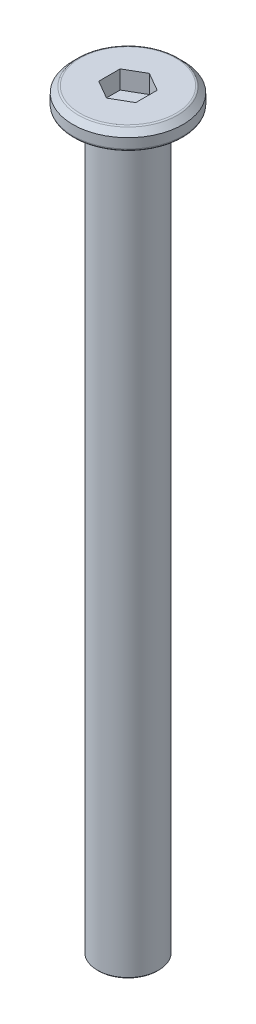
ISO-10303-21;
HEADER;
FILE_DESCRIPTION(('STEP AP214'),'2;1');
FILE_NAME('part.step','',(''),(''),'','','');
FILE_SCHEMA(('AUTOMOTIVE_DESIGN { 1 0 10303 214 1 1 1 1 }'));
ENDSEC;
DATA;
#1=APPLICATION_CONTEXT('core data for automotive mechanical design processes');
#2=APPLICATION_PROTOCOL_DEFINITION('international standard','automotive_design',2000,#1);
#3=PRODUCT_CONTEXT('',#1,'mechanical');
#4=PRODUCT('Part','Part','',(#3));
#5=PRODUCT_RELATED_PRODUCT_CATEGORY('part','',(#4));
#6=PRODUCT_DEFINITION_FORMATION('','',#4);
#7=PRODUCT_DEFINITION_CONTEXT('part definition',#1,'design');
#8=PRODUCT_DEFINITION('design','',#6,#7);
#9=PRODUCT_DEFINITION_SHAPE('','',#8);
#10=(LENGTH_UNIT() NAMED_UNIT(*) SI_UNIT(.MILLI.,.METRE.));
#11=(NAMED_UNIT(*) PLANE_ANGLE_UNIT() SI_UNIT($,.RADIAN.));
#12=(NAMED_UNIT(*) SI_UNIT($,.STERADIAN.) SOLID_ANGLE_UNIT());
#13=UNCERTAINTY_MEASURE_WITH_UNIT(LENGTH_MEASURE(1.E-05),#10,'distance_accuracy_value','');
#14=(GEOMETRIC_REPRESENTATION_CONTEXT(3) GLOBAL_UNCERTAINTY_ASSIGNED_CONTEXT((#13)) GLOBAL_UNIT_ASSIGNED_CONTEXT((#10,
#11,#12)) REPRESENTATION_CONTEXT('',''));
#15=CARTESIAN_POINT('',(0.,0.,0.));
#16=DIRECTION('',(0.,0.,1.));
#17=DIRECTION('',(1.,0.,0.));
#18=AXIS2_PLACEMENT_3D('',#15,#16,#17);
#19=CARTESIAN_POINT('',(0.,1.5,0.));
#20=DIRECTION('',(0.,-1.,0.));
#21=DIRECTION('',(0.,0.,-1.));
#22=AXIS2_PLACEMENT_3D('',#19,#20,#21);
#23=CYLINDRICAL_SURFACE('',#22,4.5);
#24=CARTESIAN_POINT('',(0.,0.2,0.));
#25=DIRECTION('',(0.,1.,0.));
#26=DIRECTION('',(0.,0.,1.));
#27=AXIS2_PLACEMENT_3D('',#24,#25,#26);
#28=CIRCLE('',#27,4.5);
#29=CARTESIAN_POINT('',(0.,0.2,4.5));
#30=VERTEX_POINT('',#29);
#31=EDGE_CURVE('E134',#30,#30,#28,.T.);
#32=ORIENTED_EDGE('',*,*,#31,.T.);
#33=EDGE_LOOP('',(#32));
#34=FACE_BOUND('',#33,.T.);
#35=CARTESIAN_POINT('',(0.,0.999999999999997,0.));
#36=DIRECTION('',(0.,1.,0.));
#37=DIRECTION('',(0.,0.,1.));
#38=AXIS2_PLACEMENT_3D('',#35,#36,#37);
#39=CIRCLE('',#38,4.5);
#40=CARTESIAN_POINT('',(0.,0.999999999999997,4.5));
#41=VERTEX_POINT('',#40);
#42=EDGE_CURVE('E117',#41,#41,#39,.F.);
#43=ORIENTED_EDGE('',*,*,#42,.T.);
#44=EDGE_LOOP('',(#43));
#45=FACE_BOUND('',#44,.T.);
#46=ADVANCED_FACE('F16',(#34,#45),#23,.T.);
#47=CARTESIAN_POINT('',(0.,1.5,0.));
#48=DIRECTION('',(0.,1.,0.));
#49=DIRECTION('',(0.,0.,1.));
#50=AXIS2_PLACEMENT_3D('',#47,#48,#49);
#51=PLANE('',#50);
#52=CARTESIAN_POINT('',(0.,1.5,0.));
#53=DIRECTION('',(0.,1.,0.));
#54=DIRECTION('',(0.,0.,1.));
#55=AXIS2_PLACEMENT_3D('',#52,#53,#54);
#56=CIRCLE('',#55,3.91715728752538);
#57=CARTESIAN_POINT('',(0.,1.5,3.91715728752538));
#58=VERTEX_POINT('',#57);
#59=EDGE_CURVE('E128',#58,#58,#56,.T.);
#60=ORIENTED_EDGE('',*,*,#59,.T.);
#61=EDGE_LOOP('',(#60));
#62=FACE_BOUND('',#61,.T.);
#63=DIRECTION('',(-0.866025403784439,0.,-0.5));
#64=VECTOR('',#63,1.);
#65=CARTESIAN_POINT('',(1.51554445662277,1.5,-0.875));
#66=LINE('',#65,#64);
#67=CARTESIAN_POINT('',(1.51554445662277,1.5,-0.875));
#68=VERTEX_POINT('',#67);
#69=CARTESIAN_POINT('',(0.,1.5,-1.75));
#70=VERTEX_POINT('',#69);
#71=EDGE_CURVE('E32',#68,#70,#66,.T.);
#72=ORIENTED_EDGE('',*,*,#71,.F.);
#73=DIRECTION('',(0.,0.,-1.));
#74=VECTOR('',#73,1.);
#75=CARTESIAN_POINT('',(1.51554445662277,1.5,0.875));
#76=LINE('',#75,#74);
#77=CARTESIAN_POINT('',(1.51554445662277,1.5,0.875));
#78=VERTEX_POINT('',#77);
#79=EDGE_CURVE('E113',#78,#68,#76,.T.);
#80=ORIENTED_EDGE('',*,*,#79,.F.);
#81=DIRECTION('',(0.866025403784439,0.,-0.5));
#82=VECTOR('',#81,1.);
#83=CARTESIAN_POINT('',(0.,1.5,1.75));
#84=LINE('',#83,#82);
#85=CARTESIAN_POINT('',(0.,1.5,1.75));
#86=VERTEX_POINT('',#85);
#87=EDGE_CURVE('E111',#86,#78,#84,.T.);
#88=ORIENTED_EDGE('',*,*,#87,.F.);
#89=DIRECTION('',(0.866025403784439,0.,0.5));
#90=VECTOR('',#89,1.);
#91=CARTESIAN_POINT('',(-1.51554445662277,1.5,0.875));
#92=LINE('',#91,#90);
#93=CARTESIAN_POINT('',(-1.51554445662277,1.5,0.875));
#94=VERTEX_POINT('',#93);
#95=EDGE_CURVE('E79',#94,#86,#92,.T.);
#96=ORIENTED_EDGE('',*,*,#95,.F.);
#97=DIRECTION('',(0.,0.,1.));
#98=VECTOR('',#97,1.);
#99=CARTESIAN_POINT('',(-1.51554445662277,1.5,-0.875000000000001));
#100=LINE('',#99,#98);
#101=CARTESIAN_POINT('',(-1.51554445662277,1.5,-0.875000000000001));
#102=VERTEX_POINT('',#101);
#103=EDGE_CURVE('E107',#102,#94,#100,.T.);
#104=ORIENTED_EDGE('',*,*,#103,.F.);
#105=DIRECTION('',(-0.866025403784439,0.,0.5));
#106=VECTOR('',#105,1.);
#107=CARTESIAN_POINT('',(0.,1.5,-1.75));
#108=LINE('',#107,#106);
#109=EDGE_CURVE('E104',#70,#102,#108,.T.);
#110=ORIENTED_EDGE('',*,*,#109,.F.);
#111=EDGE_LOOP('',(#72,#80,#88,#96,#104,#110));
#112=FACE_BOUND('',#111,.T.);
#113=ADVANCED_FACE('F155',(#62,#112),#51,.T.);
#114=CARTESIAN_POINT('',(0.,0.,0.));
#115=DIRECTION('',(0.,1.,0.));
#116=DIRECTION('',(0.,0.,1.));
#117=AXIS2_PLACEMENT_3D('',#114,#115,#116);
#118=PLANE('',#117);
#119=CARTESIAN_POINT('',(0.,0.,0.));
#120=DIRECTION('',(0.,1.,0.));
#121=DIRECTION('',(0.,0.,1.));
#122=AXIS2_PLACEMENT_3D('',#119,#120,#121);
#123=CIRCLE('',#122,4.3);
#124=CARTESIAN_POINT('',(0.,0.,4.3));
#125=VERTEX_POINT('',#124);
#126=EDGE_CURVE('E137',#125,#125,#123,.F.);
#127=ORIENTED_EDGE('',*,*,#126,.T.);
#128=EDGE_LOOP('',(#127));
#129=FACE_BOUND('',#128,.T.);
#130=CARTESIAN_POINT('',(0.,0.,0.));
#131=DIRECTION('',(0.,1.,0.));
#132=DIRECTION('',(0.,0.,1.));
#133=AXIS2_PLACEMENT_3D('',#130,#131,#132);
#134=CIRCLE('',#133,2.5);
#135=CARTESIAN_POINT('',(0.,0.,2.5));
#136=VERTEX_POINT('',#135);
#137=EDGE_CURVE('E125',#136,#136,#134,.F.);
#138=ORIENTED_EDGE('',*,*,#137,.F.);
#139=EDGE_LOOP('',(#138));
#140=FACE_BOUND('',#139,.T.);
#141=ADVANCED_FACE('F161',(#129,#140),#118,.F.);
#142=CARTESIAN_POINT('',(0.,1.5,0.));
#143=DIRECTION('',(0.,-1.,0.));
#144=DIRECTION('',(0.,0.,-1.));
#145=AXIS2_PLACEMENT_3D('',#142,#143,#144);
#146=CONICAL_SURFACE('',#145,4.,0.785398163397447);
#147=CARTESIAN_POINT('',(0.,1.44142135623731,0.));
#148=DIRECTION('',(0.,1.,0.));
#149=DIRECTION('',(0.,0.,1.));
#150=AXIS2_PLACEMENT_3D('',#147,#148,#149);
#151=CIRCLE('',#150,4.05857864376269);
#152=CARTESIAN_POINT('',(0.,1.44142135623731,4.05857864376269));
#153=VERTEX_POINT('',#152);
#154=EDGE_CURVE('E131',#153,#153,#151,.F.);
#155=ORIENTED_EDGE('',*,*,#154,.T.);
#156=EDGE_LOOP('',(#155));
#157=FACE_BOUND('',#156,.T.);
#158=ORIENTED_EDGE('',*,*,#42,.F.);
#159=EDGE_LOOP('',(#158));
#160=FACE_BOUND('',#159,.T.);
#161=ADVANCED_FACE('F167',(#157,#160),#146,.T.);
#162=CARTESIAN_POINT('',(1.51554445662277,0.,-0.875));
#163=DIRECTION('',(0.5,0.,-0.866025403784439));
#164=DIRECTION('',(-0.866025403784439,0.,-0.5));
#165=AXIS2_PLACEMENT_3D('',#162,#163,#164);
#166=PLANE('',#165);
#167=ORIENTED_EDGE('',*,*,#71,.T.);
#168=DIRECTION('',(0.,1.,0.));
#169=VECTOR('',#168,1.);
#170=CARTESIAN_POINT('',(0.,0.,-1.75));
#171=LINE('',#170,#169);
#172=CARTESIAN_POINT('',(0.,0.,-1.75));
#173=VERTEX_POINT('',#172);
#174=EDGE_CURVE('E63',#173,#70,#171,.T.);
#175=ORIENTED_EDGE('',*,*,#174,.F.);
#176=DIRECTION('',(-0.866025403784439,0.,-0.5));
#177=VECTOR('',#176,1.);
#178=CARTESIAN_POINT('',(1.51554445662277,0.,-0.875));
#179=LINE('',#178,#177);
#180=CARTESIAN_POINT('',(1.51554445662277,0.,-0.875));
#181=VERTEX_POINT('',#180);
#182=EDGE_CURVE('E115',#181,#173,#179,.T.);
#183=ORIENTED_EDGE('',*,*,#182,.F.);
#184=DIRECTION('',(0.,1.,0.));
#185=VECTOR('',#184,1.);
#186=CARTESIAN_POINT('',(1.51554445662277,0.,-0.875));
#187=LINE('',#186,#185);
#188=EDGE_CURVE('E40',#181,#68,#187,.T.);
#189=ORIENTED_EDGE('',*,*,#188,.T.);
#190=EDGE_LOOP('',(#167,#175,#183,#189));
#191=FACE_BOUND('',#190,.T.);
#192=ADVANCED_FACE('F170',(#191),#166,.F.);
#193=CARTESIAN_POINT('',(1.51554445662277,0.,0.875));
#194=DIRECTION('',(1.,0.,0.));
#195=DIRECTION('',(0.,0.,-1.));
#196=AXIS2_PLACEMENT_3D('',#193,#194,#195);
#197=PLANE('',#196);
#198=ORIENTED_EDGE('',*,*,#79,.T.);
#199=ORIENTED_EDGE('',*,*,#188,.F.);
#200=DIRECTION('',(0.,0.,-1.));
#201=VECTOR('',#200,1.);
#202=CARTESIAN_POINT('',(1.51554445662277,0.,0.875));
#203=LINE('',#202,#201);
#204=CARTESIAN_POINT('',(1.51554445662277,0.,0.875));
#205=VERTEX_POINT('',#204);
#206=EDGE_CURVE('E91',#205,#181,#203,.T.);
#207=ORIENTED_EDGE('',*,*,#206,.F.);
#208=DIRECTION('',(0.,1.,0.));
#209=VECTOR('',#208,1.);
#210=CARTESIAN_POINT('',(1.51554445662277,0.,0.875));
#211=LINE('',#210,#209);
#212=EDGE_CURVE('E83',#205,#78,#211,.T.);
#213=ORIENTED_EDGE('',*,*,#212,.T.);
#214=EDGE_LOOP('',(#198,#199,#207,#213));
#215=FACE_BOUND('',#214,.T.);
#216=ADVANCED_FACE('F192',(#215),#197,.F.);
#217=CARTESIAN_POINT('',(0.,0.,1.75));
#218=DIRECTION('',(0.5,0.,0.866025403784439));
#219=DIRECTION('',(0.866025403784439,0.,-0.5));
#220=AXIS2_PLACEMENT_3D('',#217,#218,#219);
#221=PLANE('',#220);
#222=ORIENTED_EDGE('',*,*,#87,.T.);
#223=ORIENTED_EDGE('',*,*,#212,.F.);
#224=DIRECTION('',(0.866025403784439,0.,-0.5));
#225=VECTOR('',#224,1.);
#226=CARTESIAN_POINT('',(0.,0.,1.75));
#227=LINE('',#226,#225);
#228=CARTESIAN_POINT('',(0.,0.,1.75));
#229=VERTEX_POINT('',#228);
#230=EDGE_CURVE('E87',#229,#205,#227,.T.);
#231=ORIENTED_EDGE('',*,*,#230,.F.);
#232=DIRECTION('',(0.,1.,0.));
#233=VECTOR('',#232,1.);
#234=CARTESIAN_POINT('',(0.,0.,1.75));
#235=LINE('',#234,#233);
#236=EDGE_CURVE('E72',#229,#86,#235,.T.);
#237=ORIENTED_EDGE('',*,*,#236,.T.);
#238=EDGE_LOOP('',(#222,#223,#231,#237));
#239=FACE_BOUND('',#238,.T.);
#240=ADVANCED_FACE('F88',(#239),#221,.F.);
#241=CARTESIAN_POINT('',(-1.51554445662277,0.,0.875));
#242=DIRECTION('',(-0.5,0.,0.866025403784438));
#243=DIRECTION('',(0.866025403784439,0.,0.5));
#244=AXIS2_PLACEMENT_3D('',#241,#242,#243);
#245=PLANE('',#244);
#246=ORIENTED_EDGE('',*,*,#95,.T.);
#247=ORIENTED_EDGE('',*,*,#236,.F.);
#248=DIRECTION('',(0.866025403784439,0.,0.5));
#249=VECTOR('',#248,1.);
#250=CARTESIAN_POINT('',(-1.51554445662277,0.,0.875));
#251=LINE('',#250,#249);
#252=CARTESIAN_POINT('',(-1.51554445662277,0.,0.875));
#253=VERTEX_POINT('',#252);
#254=EDGE_CURVE('E76',#253,#229,#251,.T.);
#255=ORIENTED_EDGE('',*,*,#254,.F.);
#256=DIRECTION('',(0.,1.,0.));
#257=VECTOR('',#256,1.);
#258=CARTESIAN_POINT('',(-1.51554445662277,0.,0.875));
#259=LINE('',#258,#257);
#260=EDGE_CURVE('E84',#253,#94,#259,.T.);
#261=ORIENTED_EDGE('',*,*,#260,.T.);
#262=EDGE_LOOP('',(#246,#247,#255,#261));
#263=FACE_BOUND('',#262,.T.);
#264=ADVANCED_FACE('F74',(#263),#245,.F.);
#265=CARTESIAN_POINT('',(-1.51554445662277,0.,-0.875000000000001));
#266=DIRECTION('',(-1.,0.,0.));
#267=DIRECTION('',(0.,0.,1.));
#268=AXIS2_PLACEMENT_3D('',#265,#266,#267);
#269=PLANE('',#268);
#270=ORIENTED_EDGE('',*,*,#103,.T.);
#271=ORIENTED_EDGE('',*,*,#260,.F.);
#272=DIRECTION('',(0.,0.,1.));
#273=VECTOR('',#272,1.);
#274=CARTESIAN_POINT('',(-1.51554445662277,0.,-0.875000000000001));
#275=LINE('',#274,#273);
#276=CARTESIAN_POINT('',(-1.51554445662277,0.,-0.875000000000001));
#277=VERTEX_POINT('',#276);
#278=EDGE_CURVE('E96',#277,#253,#275,.T.);
#279=ORIENTED_EDGE('',*,*,#278,.F.);
#280=DIRECTION('',(0.,1.,0.));
#281=VECTOR('',#280,1.);
#282=CARTESIAN_POINT('',(-1.51554445662277,0.,-0.875000000000001));
#283=LINE('',#282,#281);
#284=EDGE_CURVE('E120',#277,#102,#283,.T.);
#285=ORIENTED_EDGE('',*,*,#284,.T.);
#286=EDGE_LOOP('',(#270,#271,#279,#285));
#287=FACE_BOUND('',#286,.T.);
#288=ADVANCED_FACE('F201',(#287),#269,.F.);
#289=CARTESIAN_POINT('',(0.,0.,-1.75));
#290=DIRECTION('',(-0.5,0.,-0.866025403784439));
#291=DIRECTION('',(-0.866025403784439,0.,0.5));
#292=AXIS2_PLACEMENT_3D('',#289,#290,#291);
#293=PLANE('',#292);
#294=ORIENTED_EDGE('',*,*,#109,.T.);
#295=ORIENTED_EDGE('',*,*,#284,.F.);
#296=DIRECTION('',(-0.866025403784439,0.,0.5));
#297=VECTOR('',#296,1.);
#298=CARTESIAN_POINT('',(0.,0.,-1.75));
#299=LINE('',#298,#297);
#300=EDGE_CURVE('E98',#173,#277,#299,.T.);
#301=ORIENTED_EDGE('',*,*,#300,.F.);
#302=ORIENTED_EDGE('',*,*,#174,.T.);
#303=EDGE_LOOP('',(#294,#295,#301,#302));
#304=FACE_BOUND('',#303,.T.);
#305=ADVANCED_FACE('F188',(#304),#293,.F.);
#306=CARTESIAN_POINT('',(0.,0.,0.));
#307=DIRECTION('',(0.,-1.,0.));
#308=DIRECTION('',(0.,0.,-1.));
#309=AXIS2_PLACEMENT_3D('',#306,#307,#308);
#310=PLANE('',#309);
#311=ORIENTED_EDGE('',*,*,#206,.T.);
#312=ORIENTED_EDGE('',*,*,#182,.T.);
#313=ORIENTED_EDGE('',*,*,#300,.T.);
#314=ORIENTED_EDGE('',*,*,#278,.T.);
#315=ORIENTED_EDGE('',*,*,#254,.T.);
#316=ORIENTED_EDGE('',*,*,#230,.T.);
#317=EDGE_LOOP('',(#311,#312,#313,#314,#315,#316));
#318=FACE_BOUND('',#317,.T.);
#319=ADVANCED_FACE('F93',(#318),#310,.F.);
#320=CARTESIAN_POINT('',(0.,-60.,0.));
#321=DIRECTION('',(0.,1.,0.));
#322=DIRECTION('',(0.,0.,1.));
#323=AXIS2_PLACEMENT_3D('',#320,#321,#322);
#324=CYLINDRICAL_SURFACE('',#323,2.5);
#325=CARTESIAN_POINT('',(0.,-59.9,0.));
#326=DIRECTION('',(0.,-1.,0.));
#327=DIRECTION('',(0.,0.,-1.));
#328=AXIS2_PLACEMENT_3D('',#325,#326,#327);
#329=CIRCLE('',#328,2.5);
#330=CARTESIAN_POINT('',(0.,-59.9,-2.5));
#331=VERTEX_POINT('',#330);
#332=EDGE_CURVE('E10',#331,#331,#329,.F.);
#333=ORIENTED_EDGE('',*,*,#332,.T.);
#334=EDGE_LOOP('',(#333));
#335=FACE_BOUND('',#334,.T.);
#336=ORIENTED_EDGE('',*,*,#137,.T.);
#337=EDGE_LOOP('',(#336));
#338=FACE_BOUND('',#337,.T.);
#339=ADVANCED_FACE('F177',(#335,#338),#324,.T.);
#340=CARTESIAN_POINT('',(0.,-60.,0.));
#341=DIRECTION('',(0.,-1.,0.));
#342=DIRECTION('',(0.,0.,-1.));
#343=AXIS2_PLACEMENT_3D('',#340,#341,#342);
#344=PLANE('',#343);
#345=CARTESIAN_POINT('',(0.,-60.,0.));
#346=DIRECTION('',(0.,-1.,0.));
#347=DIRECTION('',(0.,0.,-1.));
#348=AXIS2_PLACEMENT_3D('',#345,#346,#347);
#349=CIRCLE('',#348,2.40000000000002);
#350=CARTESIAN_POINT('',(0.,-60.,-2.40000000000002));
#351=VERTEX_POINT('',#350);
#352=EDGE_CURVE('E25',#351,#351,#349,.T.);
#353=ORIENTED_EDGE('',*,*,#352,.T.);
#354=EDGE_LOOP('',(#353));
#355=FACE_BOUND('',#354,.T.);
#356=ADVANCED_FACE('F142',(#355),#344,.T.);
#357=CARTESIAN_POINT('',(0.,1.3,0.));
#358=DIRECTION('',(0.,1.,0.));
#359=DIRECTION('',(0.,0.,1.));
#360=AXIS2_PLACEMENT_3D('',#357,#358,#359);
#361=TOROIDAL_SURFACE('',#360,3.91715728752538,0.2);
#362=ORIENTED_EDGE('',*,*,#154,.F.);
#363=EDGE_LOOP('',(#362));
#364=FACE_BOUND('',#363,.T.);
#365=ORIENTED_EDGE('',*,*,#59,.F.);
#366=EDGE_LOOP('',(#365));
#367=FACE_BOUND('',#366,.T.);
#368=ADVANCED_FACE('F151',(#364,#367),#361,.T.);
#369=CARTESIAN_POINT('',(0.,0.2,0.));
#370=DIRECTION('',(0.,1.,0.));
#371=DIRECTION('',(0.,0.,1.));
#372=AXIS2_PLACEMENT_3D('',#369,#370,#371);
#373=TOROIDAL_SURFACE('',#372,4.3,0.2);
#374=ORIENTED_EDGE('',*,*,#126,.F.);
#375=EDGE_LOOP('',(#374));
#376=FACE_BOUND('',#375,.T.);
#377=ORIENTED_EDGE('',*,*,#31,.F.);
#378=EDGE_LOOP('',(#377));
#379=FACE_BOUND('',#378,.T.);
#380=ADVANCED_FACE('F145',(#376,#379),#373,.T.);
#381=CARTESIAN_POINT('',(0.,-60.,0.));
#382=DIRECTION('',(0.,1.,0.));
#383=DIRECTION('',(0.,0.,1.));
#384=AXIS2_PLACEMENT_3D('',#381,#382,#383);
#385=CONICAL_SURFACE('',#384,2.40000000000002,0.785398163397403);
#386=ORIENTED_EDGE('',*,*,#332,.F.);
#387=EDGE_LOOP('',(#386));
#388=FACE_BOUND('',#387,.T.);
#389=ORIENTED_EDGE('',*,*,#352,.F.);
#390=EDGE_LOOP('',(#389));
#391=FACE_BOUND('',#390,.T.);
#392=ADVANCED_FACE('F19',(#388,#391),#385,.T.);
#393=CLOSED_SHELL('',(#46,#113,#141,#161,#192,#216,#240,#264,#288,#305,#319,#339,#356,#368,#380,#392));
#394=MANIFOLD_SOLID_BREP('B1',#393);
#395=ADVANCED_BREP_SHAPE_REPRESENTATION('',(#18,#394),#14);
#396=SHAPE_DEFINITION_REPRESENTATION(#9,#395);
ENDSEC;
END-ISO-10303-21;
